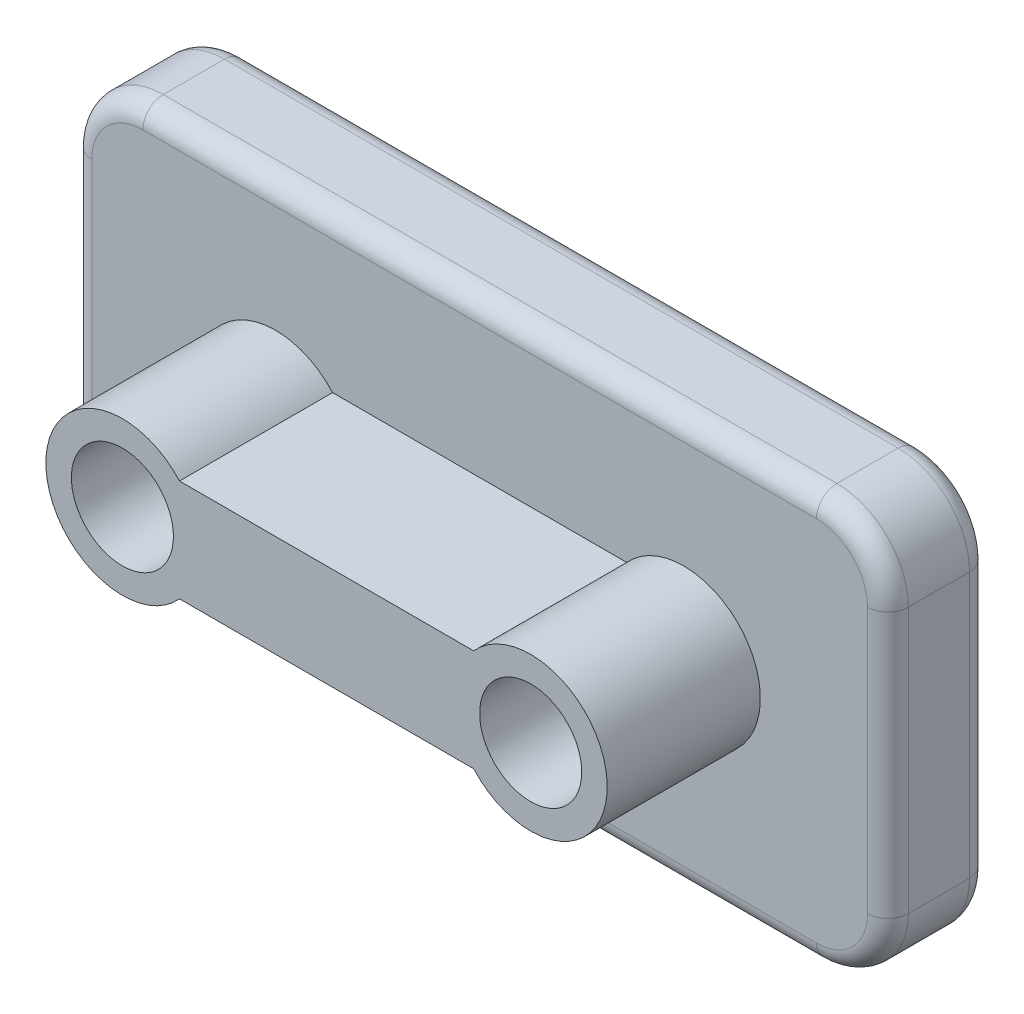
ISO-10303-21;
HEADER;
FILE_DESCRIPTION(('STEP AP214'),'2;1');
FILE_NAME('part.step','',(''),(''),'','','');
FILE_SCHEMA(('AUTOMOTIVE_DESIGN { 1 0 10303 214 1 1 1 1 }'));
ENDSEC;
DATA;
#1=APPLICATION_CONTEXT('core data for automotive mechanical design processes');
#2=APPLICATION_PROTOCOL_DEFINITION('international standard','automotive_design',2000,#1);
#3=PRODUCT_CONTEXT('',#1,'mechanical');
#4=PRODUCT('Part','Part','',(#3));
#5=PRODUCT_RELATED_PRODUCT_CATEGORY('part','',(#4));
#6=PRODUCT_DEFINITION_FORMATION('','',#4);
#7=PRODUCT_DEFINITION_CONTEXT('part definition',#1,'design');
#8=PRODUCT_DEFINITION('design','',#6,#7);
#9=PRODUCT_DEFINITION_SHAPE('','',#8);
#10=(LENGTH_UNIT() NAMED_UNIT(*) SI_UNIT(.MILLI.,.METRE.));
#11=(NAMED_UNIT(*) PLANE_ANGLE_UNIT() SI_UNIT($,.RADIAN.));
#12=(NAMED_UNIT(*) SI_UNIT($,.STERADIAN.) SOLID_ANGLE_UNIT());
#13=UNCERTAINTY_MEASURE_WITH_UNIT(LENGTH_MEASURE(1.E-05),#10,'distance_accuracy_value','');
#14=(GEOMETRIC_REPRESENTATION_CONTEXT(3) GLOBAL_UNCERTAINTY_ASSIGNED_CONTEXT((#13)) GLOBAL_UNIT_ASSIGNED_CONTEXT((#10,
#11,#12)) REPRESENTATION_CONTEXT('',''));
#15=CARTESIAN_POINT('',(0.,0.,0.));
#16=DIRECTION('',(0.,0.,1.));
#17=DIRECTION('',(1.,0.,0.));
#18=AXIS2_PLACEMENT_3D('',#15,#16,#17);
#19=CARTESIAN_POINT('',(7.,7.,10.));
#20=DIRECTION('',(0.,0.,-1.));
#21=DIRECTION('',(-1.,0.,0.));
#22=AXIS2_PLACEMENT_3D('',#19,#20,#21);
#23=CYLINDRICAL_SURFACE('',#22,7.);
#24=DIRECTION('',(0.,0.,-1.));
#25=VECTOR('',#24,1.);
#26=CARTESIAN_POINT('',(7.,0.,10.));
#27=LINE('',#26,#25);
#28=CARTESIAN_POINT('',(7.,0.,8.));
#29=VERTEX_POINT('',#28);
#30=CARTESIAN_POINT('',(7.,0.,2.));
#31=VERTEX_POINT('',#30);
#32=EDGE_CURVE('E203',#29,#31,#27,.T.);
#33=ORIENTED_EDGE('',*,*,#32,.F.);
#34=CARTESIAN_POINT('',(7.,7.,8.));
#35=DIRECTION('',(0.,0.,-1.));
#36=DIRECTION('',(-1.,0.,0.));
#37=AXIS2_PLACEMENT_3D('',#34,#35,#36);
#38=CIRCLE('',#37,7.);
#39=CARTESIAN_POINT('',(0.,7.,8.));
#40=VERTEX_POINT('',#39);
#41=EDGE_CURVE('E313',#29,#40,#38,.T.);
#42=ORIENTED_EDGE('',*,*,#41,.T.);
#43=DIRECTION('',(0.,0.,-1.));
#44=VECTOR('',#43,1.);
#45=CARTESIAN_POINT('',(0.,7.,10.));
#46=LINE('',#45,#44);
#47=CARTESIAN_POINT('',(0.,7.,2.));
#48=VERTEX_POINT('',#47);
#49=EDGE_CURVE('E219',#40,#48,#46,.T.);
#50=ORIENTED_EDGE('',*,*,#49,.T.);
#51=CARTESIAN_POINT('',(7.,7.,2.));
#52=DIRECTION('',(0.,0.,-1.));
#53=DIRECTION('',(-1.,0.,0.));
#54=AXIS2_PLACEMENT_3D('',#51,#52,#53);
#55=CIRCLE('',#54,7.);
#56=EDGE_CURVE('E258',#48,#31,#55,.F.);
#57=ORIENTED_EDGE('',*,*,#56,.T.);
#58=EDGE_LOOP('',(#33,#42,#50,#57));
#59=FACE_BOUND('',#58,.T.);
#60=ADVANCED_FACE('F33',(#59),#23,.T.);
#61=CARTESIAN_POINT('',(7.,0.,10.));
#62=DIRECTION('',(0.,1.,0.));
#63=DIRECTION('',(0.,0.,1.));
#64=AXIS2_PLACEMENT_3D('',#61,#62,#63);
#65=PLANE('',#64);
#66=DIRECTION('',(0.,0.,-1.));
#67=VECTOR('',#66,1.);
#68=CARTESIAN_POINT('',(73.,0.,10.));
#69=LINE('',#68,#67);
#70=CARTESIAN_POINT('',(73.,0.,8.));
#71=VERTEX_POINT('',#70);
#72=CARTESIAN_POINT('',(73.,0.,2.));
#73=VERTEX_POINT('',#72);
#74=EDGE_CURVE('E206',#71,#73,#69,.T.);
#75=ORIENTED_EDGE('',*,*,#74,.F.);
#76=DIRECTION('',(1.,0.,0.));
#77=VECTOR('',#76,1.);
#78=CARTESIAN_POINT('',(7.,0.,8.));
#79=LINE('',#78,#77);
#80=EDGE_CURVE('E56',#71,#29,#79,.F.);
#81=ORIENTED_EDGE('',*,*,#80,.T.);
#82=ORIENTED_EDGE('',*,*,#32,.T.);
#83=DIRECTION('',(1.,0.,0.));
#84=VECTOR('',#83,1.);
#85=CARTESIAN_POINT('',(73.,0.,2.));
#86=LINE('',#85,#84);
#87=EDGE_CURVE('E205',#31,#73,#86,.T.);
#88=ORIENTED_EDGE('',*,*,#87,.T.);
#89=EDGE_LOOP('',(#75,#81,#82,#88));
#90=FACE_BOUND('',#89,.T.);
#91=ADVANCED_FACE('F380',(#90),#65,.F.);
#92=CARTESIAN_POINT('',(73.,7.,10.));
#93=DIRECTION('',(0.,0.,-1.));
#94=DIRECTION('',(-1.,0.,0.));
#95=AXIS2_PLACEMENT_3D('',#92,#93,#94);
#96=CYLINDRICAL_SURFACE('',#95,7.);
#97=DIRECTION('',(0.,0.,-1.));
#98=VECTOR('',#97,1.);
#99=CARTESIAN_POINT('',(80.,7.,10.));
#100=LINE('',#99,#98);
#101=CARTESIAN_POINT('',(80.,7.,8.));
#102=VERTEX_POINT('',#101);
#103=CARTESIAN_POINT('',(80.,7.,2.));
#104=VERTEX_POINT('',#103);
#105=EDGE_CURVE('E208',#102,#104,#100,.T.);
#106=ORIENTED_EDGE('',*,*,#105,.F.);
#107=CARTESIAN_POINT('',(73.,7.,8.));
#108=DIRECTION('',(0.,0.,-1.));
#109=DIRECTION('',(-1.,0.,0.));
#110=AXIS2_PLACEMENT_3D('',#107,#108,#109);
#111=CIRCLE('',#110,7.);
#112=EDGE_CURVE('E310',#102,#71,#111,.T.);
#113=ORIENTED_EDGE('',*,*,#112,.T.);
#114=ORIENTED_EDGE('',*,*,#74,.T.);
#115=CARTESIAN_POINT('',(73.,7.,2.));
#116=DIRECTION('',(0.,0.,-1.));
#117=DIRECTION('',(-1.,0.,0.));
#118=AXIS2_PLACEMENT_3D('',#115,#116,#117);
#119=CIRCLE('',#118,7.);
#120=EDGE_CURVE('E242',#73,#104,#119,.F.);
#121=ORIENTED_EDGE('',*,*,#120,.T.);
#122=EDGE_LOOP('',(#106,#113,#114,#121));
#123=FACE_BOUND('',#122,.T.);
#124=ADVANCED_FACE('F383',(#123),#96,.T.);
#125=CARTESIAN_POINT('',(80.,7.,10.));
#126=DIRECTION('',(-1.,0.,0.));
#127=DIRECTION('',(0.,0.,1.));
#128=AXIS2_PLACEMENT_3D('',#125,#126,#127);
#129=PLANE('',#128);
#130=DIRECTION('',(0.,1.,0.));
#131=VECTOR('',#130,1.);
#132=CARTESIAN_POINT('',(80.,7.,8.));
#133=LINE('',#132,#131);
#134=CARTESIAN_POINT('',(80.,33.,8.));
#135=VERTEX_POINT('',#134);
#136=EDGE_CURVE('E308',#135,#102,#133,.F.);
#137=ORIENTED_EDGE('',*,*,#136,.T.);
#138=ORIENTED_EDGE('',*,*,#105,.T.);
#139=DIRECTION('',(0.,1.,0.));
#140=VECTOR('',#139,1.);
#141=CARTESIAN_POINT('',(80.,33.,2.));
#142=LINE('',#141,#140);
#143=CARTESIAN_POINT('',(80.,33.,2.));
#144=VERTEX_POINT('',#143);
#145=EDGE_CURVE('E245',#104,#144,#142,.T.);
#146=ORIENTED_EDGE('',*,*,#145,.T.);
#147=DIRECTION('',(0.,0.,-1.));
#148=VECTOR('',#147,1.);
#149=CARTESIAN_POINT('',(80.,33.,10.));
#150=LINE('',#149,#148);
#151=EDGE_CURVE('E210',#135,#144,#150,.T.);
#152=ORIENTED_EDGE('',*,*,#151,.F.);
#153=EDGE_LOOP('',(#137,#138,#146,#152));
#154=FACE_BOUND('',#153,.T.);
#155=ADVANCED_FACE('F386',(#154),#129,.F.);
#156=CARTESIAN_POINT('',(73.,33.,10.));
#157=DIRECTION('',(0.,0.,-1.));
#158=DIRECTION('',(-1.,0.,0.));
#159=AXIS2_PLACEMENT_3D('',#156,#157,#158);
#160=CYLINDRICAL_SURFACE('',#159,7.00000000000001);
#161=DIRECTION('',(0.,0.,-1.));
#162=VECTOR('',#161,1.);
#163=CARTESIAN_POINT('',(73.,40.,10.));
#164=LINE('',#163,#162);
#165=CARTESIAN_POINT('',(73.,40.,8.));
#166=VERTEX_POINT('',#165);
#167=CARTESIAN_POINT('',(73.,40.,2.));
#168=VERTEX_POINT('',#167);
#169=EDGE_CURVE('E213',#166,#168,#164,.T.);
#170=ORIENTED_EDGE('',*,*,#169,.F.);
#171=CARTESIAN_POINT('',(73.,33.,8.));
#172=DIRECTION('',(0.,0.,-1.));
#173=DIRECTION('',(-1.,0.,0.));
#174=AXIS2_PLACEMENT_3D('',#171,#172,#173);
#175=CIRCLE('',#174,7.00000000000001);
#176=EDGE_CURVE('E306',#166,#135,#175,.T.);
#177=ORIENTED_EDGE('',*,*,#176,.T.);
#178=ORIENTED_EDGE('',*,*,#151,.T.);
#179=CARTESIAN_POINT('',(73.,33.,2.));
#180=DIRECTION('',(0.,0.,-1.));
#181=DIRECTION('',(-1.,0.,0.));
#182=AXIS2_PLACEMENT_3D('',#179,#180,#181);
#183=CIRCLE('',#182,7.00000000000001);
#184=EDGE_CURVE('E247',#144,#168,#183,.F.);
#185=ORIENTED_EDGE('',*,*,#184,.T.);
#186=EDGE_LOOP('',(#170,#177,#178,#185));
#187=FACE_BOUND('',#186,.T.);
#188=ADVANCED_FACE('F391',(#187),#160,.T.);
#189=CARTESIAN_POINT('',(7.,40.,10.));
#190=DIRECTION('',(0.,1.,0.));
#191=DIRECTION('',(0.,0.,1.));
#192=AXIS2_PLACEMENT_3D('',#189,#190,#191);
#193=PLANE('',#192);
#194=DIRECTION('',(0.,0.,-1.));
#195=VECTOR('',#194,1.);
#196=CARTESIAN_POINT('',(7.,40.,10.));
#197=LINE('',#196,#195);
#198=CARTESIAN_POINT('',(7.,40.,8.));
#199=VERTEX_POINT('',#198);
#200=CARTESIAN_POINT('',(7.,40.,2.));
#201=VERTEX_POINT('',#200);
#202=EDGE_CURVE('E215',#199,#201,#197,.T.);
#203=ORIENTED_EDGE('',*,*,#202,.F.);
#204=DIRECTION('',(1.,0.,0.));
#205=VECTOR('',#204,1.);
#206=CARTESIAN_POINT('',(73.,40.,8.));
#207=LINE('',#206,#205);
#208=EDGE_CURVE('E304',#199,#166,#207,.T.);
#209=ORIENTED_EDGE('',*,*,#208,.T.);
#210=ORIENTED_EDGE('',*,*,#169,.T.);
#211=DIRECTION('',(1.,0.,0.));
#212=VECTOR('',#211,1.);
#213=CARTESIAN_POINT('',(7.,40.,2.));
#214=LINE('',#213,#212);
#215=EDGE_CURVE('E250',#168,#201,#214,.F.);
#216=ORIENTED_EDGE('',*,*,#215,.T.);
#217=EDGE_LOOP('',(#203,#209,#210,#216));
#218=FACE_BOUND('',#217,.T.);
#219=ADVANCED_FACE('F414',(#218),#193,.T.);
#220=CARTESIAN_POINT('',(7.,33.,10.));
#221=DIRECTION('',(0.,0.,-1.));
#222=DIRECTION('',(-1.,0.,0.));
#223=AXIS2_PLACEMENT_3D('',#220,#221,#222);
#224=CYLINDRICAL_SURFACE('',#223,7.);
#225=DIRECTION('',(0.,0.,-1.));
#226=VECTOR('',#225,1.);
#227=CARTESIAN_POINT('',(0.,33.,10.));
#228=LINE('',#227,#226);
#229=CARTESIAN_POINT('',(0.,33.,8.));
#230=VERTEX_POINT('',#229);
#231=CARTESIAN_POINT('',(0.,33.,2.));
#232=VERTEX_POINT('',#231);
#233=EDGE_CURVE('E217',#230,#232,#228,.T.);
#234=ORIENTED_EDGE('',*,*,#233,.F.);
#235=CARTESIAN_POINT('',(7.,33.,8.));
#236=DIRECTION('',(0.,0.,-1.));
#237=DIRECTION('',(-1.,0.,0.));
#238=AXIS2_PLACEMENT_3D('',#235,#236,#237);
#239=CIRCLE('',#238,7.);
#240=EDGE_CURVE('E302',#230,#199,#239,.T.);
#241=ORIENTED_EDGE('',*,*,#240,.T.);
#242=ORIENTED_EDGE('',*,*,#202,.T.);
#243=CARTESIAN_POINT('',(7.,33.,2.));
#244=DIRECTION('',(0.,0.,-1.));
#245=DIRECTION('',(-1.,0.,0.));
#246=AXIS2_PLACEMENT_3D('',#243,#244,#245);
#247=CIRCLE('',#246,7.);
#248=EDGE_CURVE('E253',#201,#232,#247,.F.);
#249=ORIENTED_EDGE('',*,*,#248,.T.);
#250=EDGE_LOOP('',(#234,#241,#242,#249));
#251=FACE_BOUND('',#250,.T.);
#252=ADVANCED_FACE('F431',(#251),#224,.T.);
#253=CARTESIAN_POINT('',(0.,7.,10.));
#254=DIRECTION('',(-1.,0.,0.));
#255=DIRECTION('',(0.,0.,1.));
#256=AXIS2_PLACEMENT_3D('',#253,#254,#255);
#257=PLANE('',#256);
#258=DIRECTION('',(0.,1.,0.));
#259=VECTOR('',#258,1.);
#260=CARTESIAN_POINT('',(0.,33.,8.));
#261=LINE('',#260,#259);
#262=EDGE_CURVE('E261',#40,#230,#261,.T.);
#263=ORIENTED_EDGE('',*,*,#262,.T.);
#264=ORIENTED_EDGE('',*,*,#233,.T.);
#265=DIRECTION('',(0.,1.,0.));
#266=VECTOR('',#265,1.);
#267=CARTESIAN_POINT('',(0.,7.,2.));
#268=LINE('',#267,#266);
#269=EDGE_CURVE('E256',#232,#48,#268,.F.);
#270=ORIENTED_EDGE('',*,*,#269,.T.);
#271=ORIENTED_EDGE('',*,*,#49,.F.);
#272=EDGE_LOOP('',(#263,#264,#270,#271));
#273=FACE_BOUND('',#272,.T.);
#274=ADVANCED_FACE('F362',(#273),#257,.T.);
#275=CARTESIAN_POINT('',(7.,7.,10.));
#276=DIRECTION('',(0.,0.,-1.));
#277=DIRECTION('',(-1.,0.,0.));
#278=AXIS2_PLACEMENT_3D('',#275,#276,#277);
#279=PLANE('',#278);
#280=DIRECTION('',(0.,1.,0.));
#281=VECTOR('',#280,1.);
#282=CARTESIAN_POINT('',(78.,7.,10.));
#283=LINE('',#282,#281);
#284=CARTESIAN_POINT('',(78.,7.,10.));
#285=VERTEX_POINT('',#284);
#286=CARTESIAN_POINT('',(78.,33.,10.));
#287=VERTEX_POINT('',#286);
#288=EDGE_CURVE('E292',#285,#287,#283,.T.);
#289=ORIENTED_EDGE('',*,*,#288,.T.);
#290=CARTESIAN_POINT('',(73.,33.,10.));
#291=DIRECTION('',(0.,0.,-1.));
#292=DIRECTION('',(-1.,0.,0.));
#293=AXIS2_PLACEMENT_3D('',#290,#291,#292);
#294=CIRCLE('',#293,5.00000000000001);
#295=CARTESIAN_POINT('',(73.,38.,10.));
#296=VERTEX_POINT('',#295);
#297=EDGE_CURVE('E294',#287,#296,#294,.F.);
#298=ORIENTED_EDGE('',*,*,#297,.T.);
#299=DIRECTION('',(1.,0.,0.));
#300=VECTOR('',#299,1.);
#301=CARTESIAN_POINT('',(7.,38.,10.));
#302=LINE('',#301,#300);
#303=CARTESIAN_POINT('',(7.,38.,10.));
#304=VERTEX_POINT('',#303);
#305=EDGE_CURVE('E296',#296,#304,#302,.F.);
#306=ORIENTED_EDGE('',*,*,#305,.T.);
#307=CARTESIAN_POINT('',(7.,33.,10.));
#308=DIRECTION('',(0.,0.,-1.));
#309=DIRECTION('',(-1.,0.,0.));
#310=AXIS2_PLACEMENT_3D('',#307,#308,#309);
#311=CIRCLE('',#310,5.);
#312=CARTESIAN_POINT('',(2.,33.,10.));
#313=VERTEX_POINT('',#312);
#314=EDGE_CURVE('E298',#304,#313,#311,.F.);
#315=ORIENTED_EDGE('',*,*,#314,.T.);
#316=DIRECTION('',(0.,1.,0.));
#317=VECTOR('',#316,1.);
#318=CARTESIAN_POINT('',(2.,7.,10.));
#319=LINE('',#318,#317);
#320=CARTESIAN_POINT('',(2.,7.,10.));
#321=VERTEX_POINT('',#320);
#322=EDGE_CURVE('E300',#313,#321,#319,.F.);
#323=ORIENTED_EDGE('',*,*,#322,.T.);
#324=CARTESIAN_POINT('',(7.,7.,10.));
#325=DIRECTION('',(0.,0.,-1.));
#326=DIRECTION('',(-1.,0.,0.));
#327=AXIS2_PLACEMENT_3D('',#324,#325,#326);
#328=CIRCLE('',#327,5.);
#329=CARTESIAN_POINT('',(7.,2.,10.));
#330=VERTEX_POINT('',#329);
#331=EDGE_CURVE('E286',#321,#330,#328,.F.);
#332=ORIENTED_EDGE('',*,*,#331,.T.);
#333=DIRECTION('',(1.,0.,0.));
#334=VECTOR('',#333,1.);
#335=CARTESIAN_POINT('',(7.,2.,10.));
#336=LINE('',#335,#334);
#337=CARTESIAN_POINT('',(73.,2.,10.));
#338=VERTEX_POINT('',#337);
#339=EDGE_CURVE('E288',#330,#338,#336,.T.);
#340=ORIENTED_EDGE('',*,*,#339,.T.);
#341=CARTESIAN_POINT('',(73.,7.,10.));
#342=DIRECTION('',(0.,0.,-1.));
#343=DIRECTION('',(-1.,0.,0.));
#344=AXIS2_PLACEMENT_3D('',#341,#342,#343);
#345=CIRCLE('',#344,5.);
#346=EDGE_CURVE('E290',#338,#285,#345,.F.);
#347=ORIENTED_EDGE('',*,*,#346,.T.);
#348=EDGE_LOOP('',(#289,#298,#306,#315,#323,#332,#340,#347));
#349=FACE_BOUND('',#348,.T.);
#350=DIRECTION('',(-1.,0.,0.));
#351=VECTOR('',#350,1.);
#352=CARTESIAN_POINT('',(7.,25.,10.));
#353=LINE('',#352,#351);
#354=CARTESIAN_POINT('',(54.4098300562505,25.,10.));
#355=VERTEX_POINT('',#354);
#356=CARTESIAN_POINT('',(25.5901699437495,25.,10.));
#357=VERTEX_POINT('',#356);
#358=EDGE_CURVE('E749',#355,#357,#353,.T.);
#359=ORIENTED_EDGE('',*,*,#358,.F.);
#360=CARTESIAN_POINT('',(60.,20.,10.));
#361=DIRECTION('',(0.,0.,-1.));
#362=DIRECTION('',(-1.,0.,0.));
#363=AXIS2_PLACEMENT_3D('',#360,#361,#362);
#364=CIRCLE('',#363,7.50000000000001);
#365=CARTESIAN_POINT('',(54.4098300562505,15.,10.));
#366=VERTEX_POINT('',#365);
#367=EDGE_CURVE('E41',#366,#355,#364,.F.);
#368=ORIENTED_EDGE('',*,*,#367,.F.);
#369=DIRECTION('',(-1.,0.,0.));
#370=VECTOR('',#369,1.);
#371=CARTESIAN_POINT('',(7.,15.,10.));
#372=LINE('',#371,#370);
#373=CARTESIAN_POINT('',(25.5901699437495,15.,10.));
#374=VERTEX_POINT('',#373);
#375=EDGE_CURVE('E744',#366,#374,#372,.T.);
#376=ORIENTED_EDGE('',*,*,#375,.T.);
#377=CARTESIAN_POINT('',(20.,20.,10.));
#378=DIRECTION('',(0.,0.,-1.));
#379=DIRECTION('',(-1.,0.,0.));
#380=AXIS2_PLACEMENT_3D('',#377,#378,#379);
#381=CIRCLE('',#380,7.5);
#382=EDGE_CURVE('E11',#357,#374,#381,.F.);
#383=ORIENTED_EDGE('',*,*,#382,.F.);
#384=EDGE_LOOP('',(#359,#368,#376,#383));
#385=FACE_BOUND('',#384,.T.);
#386=ADVANCED_FACE('F345',(#349,#385),#279,.F.);
#387=CARTESIAN_POINT('',(7.,7.,0.));
#388=DIRECTION('',(0.,0.,-1.));
#389=DIRECTION('',(-1.,0.,0.));
#390=AXIS2_PLACEMENT_3D('',#387,#388,#389);
#391=PLANE('',#390);
#392=DIRECTION('',(0.,1.,0.));
#393=VECTOR('',#392,1.);
#394=CARTESIAN_POINT('',(78.,7.,0.));
#395=LINE('',#394,#393);
#396=CARTESIAN_POINT('',(78.,33.,0.));
#397=VERTEX_POINT('',#396);
#398=CARTESIAN_POINT('',(78.,7.,0.));
#399=VERTEX_POINT('',#398);
#400=EDGE_CURVE('E235',#397,#399,#395,.F.);
#401=ORIENTED_EDGE('',*,*,#400,.T.);
#402=CARTESIAN_POINT('',(73.,7.,0.));
#403=DIRECTION('',(0.,0.,-1.));
#404=DIRECTION('',(-1.,0.,0.));
#405=AXIS2_PLACEMENT_3D('',#402,#403,#404);
#406=CIRCLE('',#405,5.);
#407=CARTESIAN_POINT('',(73.,2.,0.));
#408=VERTEX_POINT('',#407);
#409=EDGE_CURVE('E237',#399,#408,#406,.T.);
#410=ORIENTED_EDGE('',*,*,#409,.T.);
#411=DIRECTION('',(1.,0.,0.));
#412=VECTOR('',#411,1.);
#413=CARTESIAN_POINT('',(7.,2.,0.));
#414=LINE('',#413,#412);
#415=CARTESIAN_POINT('',(7.,2.,0.));
#416=VERTEX_POINT('',#415);
#417=EDGE_CURVE('E239',#408,#416,#414,.F.);
#418=ORIENTED_EDGE('',*,*,#417,.T.);
#419=CARTESIAN_POINT('',(7.,7.,0.));
#420=DIRECTION('',(0.,0.,-1.));
#421=DIRECTION('',(-1.,0.,0.));
#422=AXIS2_PLACEMENT_3D('',#419,#420,#421);
#423=CIRCLE('',#422,5.);
#424=CARTESIAN_POINT('',(2.,7.,0.));
#425=VERTEX_POINT('',#424);
#426=EDGE_CURVE('E225',#416,#425,#423,.T.);
#427=ORIENTED_EDGE('',*,*,#426,.T.);
#428=DIRECTION('',(0.,1.,0.));
#429=VECTOR('',#428,1.);
#430=CARTESIAN_POINT('',(2.,7.,0.));
#431=LINE('',#430,#429);
#432=CARTESIAN_POINT('',(2.,33.,0.));
#433=VERTEX_POINT('',#432);
#434=EDGE_CURVE('E227',#425,#433,#431,.T.);
#435=ORIENTED_EDGE('',*,*,#434,.T.);
#436=CARTESIAN_POINT('',(7.,33.,0.));
#437=DIRECTION('',(0.,0.,-1.));
#438=DIRECTION('',(-1.,0.,0.));
#439=AXIS2_PLACEMENT_3D('',#436,#437,#438);
#440=CIRCLE('',#439,5.);
#441=CARTESIAN_POINT('',(7.,38.,0.));
#442=VERTEX_POINT('',#441);
#443=EDGE_CURVE('E229',#433,#442,#440,.T.);
#444=ORIENTED_EDGE('',*,*,#443,.T.);
#445=DIRECTION('',(1.,0.,0.));
#446=VECTOR('',#445,1.);
#447=CARTESIAN_POINT('',(7.,38.,0.));
#448=LINE('',#447,#446);
#449=CARTESIAN_POINT('',(73.,38.,0.));
#450=VERTEX_POINT('',#449);
#451=EDGE_CURVE('E231',#442,#450,#448,.T.);
#452=ORIENTED_EDGE('',*,*,#451,.T.);
#453=CARTESIAN_POINT('',(73.,33.,0.));
#454=DIRECTION('',(0.,0.,-1.));
#455=DIRECTION('',(-1.,0.,0.));
#456=AXIS2_PLACEMENT_3D('',#453,#454,#455);
#457=CIRCLE('',#456,5.00000000000001);
#458=EDGE_CURVE('E233',#450,#397,#457,.T.);
#459=ORIENTED_EDGE('',*,*,#458,.T.);
#460=EDGE_LOOP('',(#401,#410,#418,#427,#435,#444,#452,#459));
#461=FACE_BOUND('',#460,.T.);
#462=ADVANCED_FACE('F405',(#461),#391,.T.);
#463=CARTESIAN_POINT('',(7.,38.,2.));
#464=DIRECTION('',(1.,0.,0.));
#465=DIRECTION('',(0.,0.,-1.));
#466=AXIS2_PLACEMENT_3D('',#463,#464,#465);
#467=CYLINDRICAL_SURFACE('',#466,2.);
#468=CARTESIAN_POINT('',(73.,38.,2.));
#469=DIRECTION('',(1.,0.,0.));
#470=DIRECTION('',(0.,0.,-1.));
#471=AXIS2_PLACEMENT_3D('',#468,#469,#470);
#472=CIRCLE('',#471,2.);
#473=EDGE_CURVE('E280',#450,#168,#472,.T.);
#474=ORIENTED_EDGE('',*,*,#473,.F.);
#475=ORIENTED_EDGE('',*,*,#451,.F.);
#476=CARTESIAN_POINT('',(7.,38.,2.));
#477=DIRECTION('',(-1.,0.,0.));
#478=DIRECTION('',(0.,0.,1.));
#479=AXIS2_PLACEMENT_3D('',#476,#477,#478);
#480=CIRCLE('',#479,2.);
#481=EDGE_CURVE('E222',#201,#442,#480,.T.);
#482=ORIENTED_EDGE('',*,*,#481,.F.);
#483=ORIENTED_EDGE('',*,*,#215,.F.);
#484=EDGE_LOOP('',(#474,#475,#482,#483));
#485=FACE_BOUND('',#484,.T.);
#486=ADVANCED_FACE('F410',(#485),#467,.T.);
#487=CARTESIAN_POINT('',(7.,33.,2.));
#488=DIRECTION('',(0.,0.,-1.));
#489=DIRECTION('',(-1.,0.,0.));
#490=AXIS2_PLACEMENT_3D('',#487,#488,#489);
#491=TOROIDAL_SURFACE('',#490,5.,2.);
#492=ORIENTED_EDGE('',*,*,#481,.T.);
#493=ORIENTED_EDGE('',*,*,#443,.F.);
#494=CARTESIAN_POINT('',(2.,33.,2.));
#495=DIRECTION('',(0.,-1.,0.));
#496=DIRECTION('',(0.,0.,-1.));
#497=AXIS2_PLACEMENT_3D('',#494,#495,#496);
#498=CIRCLE('',#497,2.);
#499=EDGE_CURVE('E277',#232,#433,#498,.T.);
#500=ORIENTED_EDGE('',*,*,#499,.F.);
#501=ORIENTED_EDGE('',*,*,#248,.F.);
#502=EDGE_LOOP('',(#492,#493,#500,#501));
#503=FACE_BOUND('',#502,.T.);
#504=ADVANCED_FACE('F433',(#503),#491,.T.);
#505=CARTESIAN_POINT('',(73.,33.,2.));
#506=DIRECTION('',(0.,0.,-1.));
#507=DIRECTION('',(-1.,0.,0.));
#508=AXIS2_PLACEMENT_3D('',#505,#506,#507);
#509=TOROIDAL_SURFACE('',#508,5.00000000000001,2.);
#510=ORIENTED_EDGE('',*,*,#473,.T.);
#511=ORIENTED_EDGE('',*,*,#184,.F.);
#512=CARTESIAN_POINT('',(78.,33.,2.));
#513=DIRECTION('',(0.,-1.,0.));
#514=DIRECTION('',(0.,0.,-1.));
#515=AXIS2_PLACEMENT_3D('',#512,#513,#514);
#516=CIRCLE('',#515,2.);
#517=EDGE_CURVE('E274',#397,#144,#516,.T.);
#518=ORIENTED_EDGE('',*,*,#517,.F.);
#519=ORIENTED_EDGE('',*,*,#458,.F.);
#520=EDGE_LOOP('',(#510,#511,#518,#519));
#521=FACE_BOUND('',#520,.T.);
#522=ADVANCED_FACE('F396',(#521),#509,.T.);
#523=CARTESIAN_POINT('',(2.,7.,2.));
#524=DIRECTION('',(0.,1.,0.));
#525=DIRECTION('',(0.,0.,1.));
#526=AXIS2_PLACEMENT_3D('',#523,#524,#525);
#527=CYLINDRICAL_SURFACE('',#526,2.);
#528=CARTESIAN_POINT('',(2.,7.,2.));
#529=DIRECTION('',(0.,-1.,0.));
#530=DIRECTION('',(0.,0.,-1.));
#531=AXIS2_PLACEMENT_3D('',#528,#529,#530);
#532=CIRCLE('',#531,2.);
#533=EDGE_CURVE('E271',#48,#425,#532,.T.);
#534=ORIENTED_EDGE('',*,*,#533,.F.);
#535=ORIENTED_EDGE('',*,*,#269,.F.);
#536=ORIENTED_EDGE('',*,*,#499,.T.);
#537=ORIENTED_EDGE('',*,*,#434,.F.);
#538=EDGE_LOOP('',(#534,#535,#536,#537));
#539=FACE_BOUND('',#538,.T.);
#540=ADVANCED_FACE('F366',(#539),#527,.T.);
#541=CARTESIAN_POINT('',(78.,7.,2.));
#542=DIRECTION('',(0.,-1.,0.));
#543=DIRECTION('',(0.,0.,-1.));
#544=AXIS2_PLACEMENT_3D('',#541,#542,#543);
#545=CYLINDRICAL_SURFACE('',#544,2.);
#546=ORIENTED_EDGE('',*,*,#517,.T.);
#547=ORIENTED_EDGE('',*,*,#145,.F.);
#548=CARTESIAN_POINT('',(78.,7.,2.));
#549=DIRECTION('',(0.,-1.,0.));
#550=DIRECTION('',(0.,0.,-1.));
#551=AXIS2_PLACEMENT_3D('',#548,#549,#550);
#552=CIRCLE('',#551,2.);
#553=EDGE_CURVE('E268',#399,#104,#552,.T.);
#554=ORIENTED_EDGE('',*,*,#553,.F.);
#555=ORIENTED_EDGE('',*,*,#400,.F.);
#556=EDGE_LOOP('',(#546,#547,#554,#555));
#557=FACE_BOUND('',#556,.T.);
#558=ADVANCED_FACE('F401',(#557),#545,.T.);
#559=CARTESIAN_POINT('',(7.,7.,2.));
#560=DIRECTION('',(0.,0.,-1.));
#561=DIRECTION('',(-1.,0.,0.));
#562=AXIS2_PLACEMENT_3D('',#559,#560,#561);
#563=TOROIDAL_SURFACE('',#562,5.,2.);
#564=ORIENTED_EDGE('',*,*,#533,.T.);
#565=ORIENTED_EDGE('',*,*,#426,.F.);
#566=CARTESIAN_POINT('',(7.,2.,2.));
#567=DIRECTION('',(1.,0.,0.));
#568=DIRECTION('',(0.,0.,-1.));
#569=AXIS2_PLACEMENT_3D('',#566,#567,#568);
#570=CIRCLE('',#569,2.);
#571=EDGE_CURVE('E265',#31,#416,#570,.T.);
#572=ORIENTED_EDGE('',*,*,#571,.F.);
#573=ORIENTED_EDGE('',*,*,#56,.F.);
#574=EDGE_LOOP('',(#564,#565,#572,#573));
#575=FACE_BOUND('',#574,.T.);
#576=ADVANCED_FACE('F373',(#575),#563,.T.);
#577=CARTESIAN_POINT('',(73.,7.,2.));
#578=DIRECTION('',(0.,0.,-1.));
#579=DIRECTION('',(-1.,0.,0.));
#580=AXIS2_PLACEMENT_3D('',#577,#578,#579);
#581=TOROIDAL_SURFACE('',#580,5.,2.);
#582=ORIENTED_EDGE('',*,*,#553,.T.);
#583=ORIENTED_EDGE('',*,*,#120,.F.);
#584=CARTESIAN_POINT('',(73.,2.,2.));
#585=DIRECTION('',(-1.,0.,0.));
#586=DIRECTION('',(0.,0.,1.));
#587=AXIS2_PLACEMENT_3D('',#584,#585,#586);
#588=CIRCLE('',#587,2.);
#589=EDGE_CURVE('E262',#408,#73,#588,.T.);
#590=ORIENTED_EDGE('',*,*,#589,.F.);
#591=ORIENTED_EDGE('',*,*,#409,.F.);
#592=EDGE_LOOP('',(#582,#583,#590,#591));
#593=FACE_BOUND('',#592,.T.);
#594=ADVANCED_FACE('F453',(#593),#581,.T.);
#595=CARTESIAN_POINT('',(7.,2.,2.));
#596=DIRECTION('',(-1.,0.,0.));
#597=DIRECTION('',(0.,0.,1.));
#598=AXIS2_PLACEMENT_3D('',#595,#596,#597);
#599=CYLINDRICAL_SURFACE('',#598,2.);
#600=ORIENTED_EDGE('',*,*,#571,.T.);
#601=ORIENTED_EDGE('',*,*,#417,.F.);
#602=ORIENTED_EDGE('',*,*,#589,.T.);
#603=ORIENTED_EDGE('',*,*,#87,.F.);
#604=EDGE_LOOP('',(#600,#601,#602,#603));
#605=FACE_BOUND('',#604,.T.);
#606=ADVANCED_FACE('F377',(#605),#599,.T.);
#607=CARTESIAN_POINT('',(78.,7.,8.));
#608=DIRECTION('',(0.,1.,0.));
#609=DIRECTION('',(0.,0.,1.));
#610=AXIS2_PLACEMENT_3D('',#607,#608,#609);
#611=CYLINDRICAL_SURFACE('',#610,2.);
#612=CARTESIAN_POINT('',(78.,33.,8.));
#613=DIRECTION('',(0.,1.,0.));
#614=DIRECTION('',(0.,0.,1.));
#615=AXIS2_PLACEMENT_3D('',#612,#613,#614);
#616=CIRCLE('',#615,2.);
#617=EDGE_CURVE('E329',#287,#135,#616,.T.);
#618=ORIENTED_EDGE('',*,*,#617,.F.);
#619=ORIENTED_EDGE('',*,*,#288,.F.);
#620=CARTESIAN_POINT('',(78.,7.,8.));
#621=DIRECTION('',(0.,-1.,0.));
#622=DIRECTION('',(0.,0.,-1.));
#623=AXIS2_PLACEMENT_3D('',#620,#621,#622);
#624=CIRCLE('',#623,2.);
#625=EDGE_CURVE('E266',#102,#285,#624,.T.);
#626=ORIENTED_EDGE('',*,*,#625,.F.);
#627=ORIENTED_EDGE('',*,*,#136,.F.);
#628=EDGE_LOOP('',(#618,#619,#626,#627));
#629=FACE_BOUND('',#628,.T.);
#630=ADVANCED_FACE('F35',(#629),#611,.T.);
#631=CARTESIAN_POINT('',(73.,7.,8.));
#632=DIRECTION('',(0.,0.,-1.));
#633=DIRECTION('',(-1.,0.,0.));
#634=AXIS2_PLACEMENT_3D('',#631,#632,#633);
#635=TOROIDAL_SURFACE('',#634,5.,2.);
#636=ORIENTED_EDGE('',*,*,#625,.T.);
#637=ORIENTED_EDGE('',*,*,#346,.F.);
#638=CARTESIAN_POINT('',(73.,2.,8.));
#639=DIRECTION('',(-1.,0.,0.));
#640=DIRECTION('',(0.,0.,1.));
#641=AXIS2_PLACEMENT_3D('',#638,#639,#640);
#642=CIRCLE('',#641,2.);
#643=EDGE_CURVE('E326',#71,#338,#642,.T.);
#644=ORIENTED_EDGE('',*,*,#643,.F.);
#645=ORIENTED_EDGE('',*,*,#112,.F.);
#646=EDGE_LOOP('',(#636,#637,#644,#645));
#647=FACE_BOUND('',#646,.T.);
#648=ADVANCED_FACE('F337',(#647),#635,.T.);
#649=CARTESIAN_POINT('',(73.,33.,8.));
#650=DIRECTION('',(0.,0.,-1.));
#651=DIRECTION('',(-1.,0.,0.));
#652=AXIS2_PLACEMENT_3D('',#649,#650,#651);
#653=TOROIDAL_SURFACE('',#652,5.00000000000001,2.);
#654=ORIENTED_EDGE('',*,*,#617,.T.);
#655=ORIENTED_EDGE('',*,*,#176,.F.);
#656=CARTESIAN_POINT('',(73.,38.,8.));
#657=DIRECTION('',(-1.,0.,0.));
#658=DIRECTION('',(0.,0.,1.));
#659=AXIS2_PLACEMENT_3D('',#656,#657,#658);
#660=CIRCLE('',#659,2.);
#661=EDGE_CURVE('E323',#296,#166,#660,.T.);
#662=ORIENTED_EDGE('',*,*,#661,.F.);
#663=ORIENTED_EDGE('',*,*,#297,.F.);
#664=EDGE_LOOP('',(#654,#655,#662,#663));
#665=FACE_BOUND('',#664,.T.);
#666=ADVANCED_FACE('F417',(#665),#653,.T.);
#667=CARTESIAN_POINT('',(7.,2.,8.));
#668=DIRECTION('',(1.,0.,0.));
#669=DIRECTION('',(0.,0.,-1.));
#670=AXIS2_PLACEMENT_3D('',#667,#668,#669);
#671=CYLINDRICAL_SURFACE('',#670,2.);
#672=ORIENTED_EDGE('',*,*,#643,.T.);
#673=ORIENTED_EDGE('',*,*,#339,.F.);
#674=CARTESIAN_POINT('',(7.,2.,8.));
#675=DIRECTION('',(-1.,0.,0.));
#676=DIRECTION('',(0.,0.,1.));
#677=AXIS2_PLACEMENT_3D('',#674,#675,#676);
#678=CIRCLE('',#677,2.);
#679=EDGE_CURVE('E320',#29,#330,#678,.T.);
#680=ORIENTED_EDGE('',*,*,#679,.F.);
#681=ORIENTED_EDGE('',*,*,#80,.F.);
#682=EDGE_LOOP('',(#672,#673,#680,#681));
#683=FACE_BOUND('',#682,.T.);
#684=ADVANCED_FACE('F352',(#683),#671,.T.);
#685=CARTESIAN_POINT('',(7.,38.,8.));
#686=DIRECTION('',(-1.,0.,0.));
#687=DIRECTION('',(0.,0.,1.));
#688=AXIS2_PLACEMENT_3D('',#685,#686,#687);
#689=CYLINDRICAL_SURFACE('',#688,2.);
#690=ORIENTED_EDGE('',*,*,#661,.T.);
#691=ORIENTED_EDGE('',*,*,#208,.F.);
#692=CARTESIAN_POINT('',(7.,38.,8.));
#693=DIRECTION('',(-1.,0.,0.));
#694=DIRECTION('',(0.,0.,1.));
#695=AXIS2_PLACEMENT_3D('',#692,#693,#694);
#696=CIRCLE('',#695,2.);
#697=EDGE_CURVE('E317',#304,#199,#696,.T.);
#698=ORIENTED_EDGE('',*,*,#697,.F.);
#699=ORIENTED_EDGE('',*,*,#305,.F.);
#700=EDGE_LOOP('',(#690,#691,#698,#699));
#701=FACE_BOUND('',#700,.T.);
#702=ADVANCED_FACE('F420',(#701),#689,.T.);
#703=CARTESIAN_POINT('',(7.,7.,8.));
#704=DIRECTION('',(0.,0.,-1.));
#705=DIRECTION('',(-1.,0.,0.));
#706=AXIS2_PLACEMENT_3D('',#703,#704,#705);
#707=TOROIDAL_SURFACE('',#706,5.,2.);
#708=ORIENTED_EDGE('',*,*,#679,.T.);
#709=ORIENTED_EDGE('',*,*,#331,.F.);
#710=CARTESIAN_POINT('',(2.,7.,8.));
#711=DIRECTION('',(0.,1.,0.));
#712=DIRECTION('',(0.,0.,1.));
#713=AXIS2_PLACEMENT_3D('',#710,#711,#712);
#714=CIRCLE('',#713,2.);
#715=EDGE_CURVE('E197',#40,#321,#714,.T.);
#716=ORIENTED_EDGE('',*,*,#715,.F.);
#717=ORIENTED_EDGE('',*,*,#41,.F.);
#718=EDGE_LOOP('',(#708,#709,#716,#717));
#719=FACE_BOUND('',#718,.T.);
#720=ADVANCED_FACE('F355',(#719),#707,.T.);
#721=CARTESIAN_POINT('',(7.,33.,8.));
#722=DIRECTION('',(0.,0.,-1.));
#723=DIRECTION('',(-1.,0.,0.));
#724=AXIS2_PLACEMENT_3D('',#721,#722,#723);
#725=TOROIDAL_SURFACE('',#724,5.,2.);
#726=ORIENTED_EDGE('',*,*,#697,.T.);
#727=ORIENTED_EDGE('',*,*,#240,.F.);
#728=CARTESIAN_POINT('',(2.,33.,8.));
#729=DIRECTION('',(0.,-1.,0.));
#730=DIRECTION('',(0.,0.,-1.));
#731=AXIS2_PLACEMENT_3D('',#728,#729,#730);
#732=CIRCLE('',#731,2.);
#733=EDGE_CURVE('E193',#313,#230,#732,.T.);
#734=ORIENTED_EDGE('',*,*,#733,.F.);
#735=ORIENTED_EDGE('',*,*,#314,.F.);
#736=EDGE_LOOP('',(#726,#727,#734,#735));
#737=FACE_BOUND('',#736,.T.);
#738=ADVANCED_FACE('F429',(#737),#725,.T.);
#739=CARTESIAN_POINT('',(2.,7.,8.));
#740=DIRECTION('',(0.,-1.,0.));
#741=DIRECTION('',(0.,0.,-1.));
#742=AXIS2_PLACEMENT_3D('',#739,#740,#741);
#743=CYLINDRICAL_SURFACE('',#742,2.);
#744=ORIENTED_EDGE('',*,*,#715,.T.);
#745=ORIENTED_EDGE('',*,*,#322,.F.);
#746=ORIENTED_EDGE('',*,*,#733,.T.);
#747=ORIENTED_EDGE('',*,*,#262,.F.);
#748=EDGE_LOOP('',(#744,#745,#746,#747));
#749=FACE_BOUND('',#748,.T.);
#750=ADVANCED_FACE('F427',(#749),#743,.T.);
#751=CARTESIAN_POINT('',(60.,20.,25.));
#752=DIRECTION('',(0.,0.,-1.));
#753=DIRECTION('',(-1.,0.,0.));
#754=AXIS2_PLACEMENT_3D('',#751,#752,#753);
#755=CYLINDRICAL_SURFACE('',#754,7.50000000000001);
#756=CARTESIAN_POINT('',(60.,20.,25.));
#757=DIRECTION('',(0.,0.,1.));
#758=DIRECTION('',(1.,0.,0.));
#759=AXIS2_PLACEMENT_3D('',#756,#757,#758);
#760=CIRCLE('',#759,7.50000000000001);
#761=CARTESIAN_POINT('',(54.4098300562505,15.,25.));
#762=VERTEX_POINT('',#761);
#763=CARTESIAN_POINT('',(54.4098300562505,25.,25.));
#764=VERTEX_POINT('',#763);
#765=EDGE_CURVE('E187',#762,#764,#760,.T.);
#766=ORIENTED_EDGE('',*,*,#765,.F.);
#767=DIRECTION('',(0.,0.,-1.));
#768=VECTOR('',#767,1.);
#769=CARTESIAN_POINT('',(54.4098300562505,15.,25.));
#770=LINE('',#769,#768);
#771=EDGE_CURVE('E189',#366,#762,#770,.F.);
#772=ORIENTED_EDGE('',*,*,#771,.F.);
#773=ORIENTED_EDGE('',*,*,#367,.T.);
#774=DIRECTION('',(0.,0.,-1.));
#775=VECTOR('',#774,1.);
#776=CARTESIAN_POINT('',(54.4098300562505,25.,25.));
#777=LINE('',#776,#775);
#778=EDGE_CURVE('E175',#355,#764,#777,.F.);
#779=ORIENTED_EDGE('',*,*,#778,.T.);
#780=EDGE_LOOP('',(#766,#772,#773,#779));
#781=FACE_BOUND('',#780,.T.);
#782=ADVANCED_FACE('F185',(#781),#755,.T.);
#783=CARTESIAN_POINT('',(60.,20.,25.));
#784=DIRECTION('',(0.,0.,1.));
#785=DIRECTION('',(1.,0.,0.));
#786=AXIS2_PLACEMENT_3D('',#783,#784,#785);
#787=PLANE('',#786);
#788=CARTESIAN_POINT('',(60.,20.,25.));
#789=DIRECTION('',(0.,0.,1.));
#790=DIRECTION('',(1.,0.,0.));
#791=AXIS2_PLACEMENT_3D('',#788,#789,#790);
#792=CIRCLE('',#791,5.);
#793=CARTESIAN_POINT('',(65.,20.,25.));
#794=VERTEX_POINT('',#793);
#795=EDGE_CURVE('E748',#794,#794,#792,.T.);
#796=ORIENTED_EDGE('',*,*,#795,.F.);
#797=EDGE_LOOP('',(#796));
#798=FACE_BOUND('',#797,.T.);
#799=ORIENTED_EDGE('',*,*,#765,.T.);
#800=DIRECTION('',(1.,0.,0.));
#801=VECTOR('',#800,1.);
#802=CARTESIAN_POINT('',(48.4361377084438,25.,25.));
#803=LINE('',#802,#801);
#804=CARTESIAN_POINT('',(25.5901699437495,25.,25.));
#805=VERTEX_POINT('',#804);
#806=EDGE_CURVE('E172',#764,#805,#803,.F.);
#807=ORIENTED_EDGE('',*,*,#806,.T.);
#808=CARTESIAN_POINT('',(20.,20.,25.));
#809=DIRECTION('',(0.,0.,1.));
#810=DIRECTION('',(1.,0.,0.));
#811=AXIS2_PLACEMENT_3D('',#808,#809,#810);
#812=CIRCLE('',#811,7.5);
#813=CARTESIAN_POINT('',(25.5901699437495,15.,25.));
#814=VERTEX_POINT('',#813);
#815=EDGE_CURVE('E194',#805,#814,#812,.T.);
#816=ORIENTED_EDGE('',*,*,#815,.T.);
#817=DIRECTION('',(1.,0.,0.));
#818=VECTOR('',#817,1.);
#819=CARTESIAN_POINT('',(48.4361377084438,15.,25.));
#820=LINE('',#819,#818);
#821=EDGE_CURVE('E48',#762,#814,#820,.F.);
#822=ORIENTED_EDGE('',*,*,#821,.F.);
#823=EDGE_LOOP('',(#799,#807,#816,#822));
#824=FACE_BOUND('',#823,.T.);
#825=CARTESIAN_POINT('',(20.,20.,25.));
#826=DIRECTION('',(0.,0.,1.));
#827=DIRECTION('',(1.,0.,0.));
#828=AXIS2_PLACEMENT_3D('',#825,#826,#827);
#829=CIRCLE('',#828,5.);
#830=CARTESIAN_POINT('',(25.,20.,25.));
#831=VERTEX_POINT('',#830);
#832=EDGE_CURVE('E761',#831,#831,#829,.T.);
#833=ORIENTED_EDGE('',*,*,#832,.F.);
#834=EDGE_LOOP('',(#833));
#835=FACE_BOUND('',#834,.T.);
#836=ADVANCED_FACE('F191',(#798,#824,#835),#787,.T.);
#837=CARTESIAN_POINT('',(20.,20.,25.));
#838=DIRECTION('',(0.,0.,-1.));
#839=DIRECTION('',(-1.,0.,0.));
#840=AXIS2_PLACEMENT_3D('',#837,#838,#839);
#841=CYLINDRICAL_SURFACE('',#840,7.5);
#842=DIRECTION('',(0.,0.,-1.));
#843=VECTOR('',#842,1.);
#844=CARTESIAN_POINT('',(25.5901699437495,15.,25.));
#845=LINE('',#844,#843);
#846=EDGE_CURVE('E746',#374,#814,#845,.F.);
#847=ORIENTED_EDGE('',*,*,#846,.T.);
#848=ORIENTED_EDGE('',*,*,#815,.F.);
#849=DIRECTION('',(0.,0.,-1.));
#850=VECTOR('',#849,1.);
#851=CARTESIAN_POINT('',(25.5901699437495,25.,25.));
#852=LINE('',#851,#850);
#853=EDGE_CURVE('E177',#357,#805,#852,.F.);
#854=ORIENTED_EDGE('',*,*,#853,.F.);
#855=ORIENTED_EDGE('',*,*,#382,.T.);
#856=EDGE_LOOP('',(#847,#848,#854,#855));
#857=FACE_BOUND('',#856,.T.);
#858=ADVANCED_FACE('F543',(#857),#841,.T.);
#859=CARTESIAN_POINT('',(7.,7.,10.));
#860=DIRECTION('',(0.,0.,-1.));
#861=DIRECTION('',(-1.,0.,0.));
#862=AXIS2_PLACEMENT_3D('',#859,#860,#861);
#863=PLANE('',#862);
#864=CARTESIAN_POINT('',(20.,20.,10.));
#865=DIRECTION('',(0.,0.,-1.));
#866=DIRECTION('',(-1.,0.,0.));
#867=AXIS2_PLACEMENT_3D('',#864,#865,#866);
#868=CIRCLE('',#867,5.);
#869=CARTESIAN_POINT('',(15.,20.,10.));
#870=VERTEX_POINT('',#869);
#871=EDGE_CURVE('E199',#870,#870,#868,.F.);
#872=ORIENTED_EDGE('',*,*,#871,.T.);
#873=EDGE_LOOP('',(#872));
#874=FACE_BOUND('',#873,.T.);
#875=ADVANCED_FACE('F551',(#874),#863,.F.);
#876=CARTESIAN_POINT('',(20.,20.,-4.14213562373095));
#877=DIRECTION('',(0.,0.,1.));
#878=DIRECTION('',(1.,0.,0.));
#879=AXIS2_PLACEMENT_3D('',#876,#877,#878);
#880=CYLINDRICAL_SURFACE('',#879,5.);
#881=ORIENTED_EDGE('',*,*,#871,.F.);
#882=EDGE_LOOP('',(#881));
#883=FACE_BOUND('',#882,.T.);
#884=ORIENTED_EDGE('',*,*,#832,.T.);
#885=EDGE_LOOP('',(#884));
#886=FACE_BOUND('',#885,.T.);
#887=ADVANCED_FACE('F559',(#883,#886),#880,.F.);
#888=CARTESIAN_POINT('',(7.,7.,10.));
#889=DIRECTION('',(0.,0.,-1.));
#890=DIRECTION('',(-1.,0.,0.));
#891=AXIS2_PLACEMENT_3D('',#888,#889,#890);
#892=PLANE('',#891);
#893=CARTESIAN_POINT('',(60.,20.,10.));
#894=DIRECTION('',(0.,0.,-1.));
#895=DIRECTION('',(-1.,0.,0.));
#896=AXIS2_PLACEMENT_3D('',#893,#894,#895);
#897=CIRCLE('',#896,5.);
#898=CARTESIAN_POINT('',(65.,20.,10.));
#899=VERTEX_POINT('',#898);
#900=EDGE_CURVE('E758',#899,#899,#897,.F.);
#901=ORIENTED_EDGE('',*,*,#900,.T.);
#902=EDGE_LOOP('',(#901));
#903=FACE_BOUND('',#902,.T.);
#904=ADVANCED_FACE('F567',(#903),#892,.F.);
#905=CARTESIAN_POINT('',(60.,20.,-4.14213562373096));
#906=DIRECTION('',(0.,0.,1.));
#907=DIRECTION('',(1.,0.,0.));
#908=AXIS2_PLACEMENT_3D('',#905,#906,#907);
#909=CYLINDRICAL_SURFACE('',#908,5.);
#910=CARTESIAN_POINT('',(65.,20.,10.));
#911=CARTESIAN_POINT('',(65.,20.,10.15625));
#912=CARTESIAN_POINT('',(65.,20.,10.3125));
#913=CARTESIAN_POINT('',(65.,20.,10.625));
#914=CARTESIAN_POINT('',(65.,20.,10.78125));
#915=CARTESIAN_POINT('',(65.,20.,11.09375));
#916=CARTESIAN_POINT('',(65.,20.,11.25));
#917=CARTESIAN_POINT('',(65.,20.,11.5625));
#918=CARTESIAN_POINT('',(65.,20.,11.71875));
#919=CARTESIAN_POINT('',(65.,20.,12.03125));
#920=CARTESIAN_POINT('',(65.,20.,12.1875));
#921=CARTESIAN_POINT('',(65.,20.,12.5));
#922=CARTESIAN_POINT('',(65.,20.,12.65625));
#923=CARTESIAN_POINT('',(65.,20.,12.96875));
#924=CARTESIAN_POINT('',(65.,20.,13.125));
#925=CARTESIAN_POINT('',(65.,20.,13.4375));
#926=CARTESIAN_POINT('',(65.,20.,13.59375));
#927=CARTESIAN_POINT('',(65.,20.,13.90625));
#928=CARTESIAN_POINT('',(65.,20.,14.0625));
#929=CARTESIAN_POINT('',(65.,20.,14.375));
#930=CARTESIAN_POINT('',(65.,20.,14.53125));
#931=CARTESIAN_POINT('',(65.,20.,14.84375));
#932=CARTESIAN_POINT('',(65.,20.,15.));
#933=CARTESIAN_POINT('',(65.,20.,15.3125));
#934=CARTESIAN_POINT('',(65.,20.,15.46875));
#935=CARTESIAN_POINT('',(65.,20.,15.78125));
#936=CARTESIAN_POINT('',(65.,20.,15.9375));
#937=CARTESIAN_POINT('',(65.,20.,16.25));
#938=CARTESIAN_POINT('',(65.,20.,16.40625));
#939=CARTESIAN_POINT('',(65.,20.,16.71875));
#940=CARTESIAN_POINT('',(65.,20.,16.875));
#941=CARTESIAN_POINT('',(65.,20.,17.1875));
#942=CARTESIAN_POINT('',(65.,20.,17.34375));
#943=CARTESIAN_POINT('',(65.,20.,17.65625));
#944=CARTESIAN_POINT('',(65.,20.,17.8125));
#945=CARTESIAN_POINT('',(65.,20.,18.125));
#946=CARTESIAN_POINT('',(65.,20.,18.28125));
#947=CARTESIAN_POINT('',(65.,20.,18.59375));
#948=CARTESIAN_POINT('',(65.,20.,18.75));
#949=CARTESIAN_POINT('',(65.,20.,19.0625));
#950=CARTESIAN_POINT('',(65.,20.,19.21875));
#951=CARTESIAN_POINT('',(65.,20.,19.53125));
#952=CARTESIAN_POINT('',(65.,20.,19.6875));
#953=CARTESIAN_POINT('',(65.,20.,20.));
#954=CARTESIAN_POINT('',(65.,20.,20.15625));
#955=CARTESIAN_POINT('',(65.,20.,20.46875));
#956=CARTESIAN_POINT('',(65.,20.,20.625));
#957=CARTESIAN_POINT('',(65.,20.,20.9375));
#958=CARTESIAN_POINT('',(65.,20.,21.09375));
#959=CARTESIAN_POINT('',(65.,20.,21.40625));
#960=CARTESIAN_POINT('',(65.,20.,21.5625));
#961=CARTESIAN_POINT('',(65.,20.,21.875));
#962=CARTESIAN_POINT('',(65.,20.,22.03125));
#963=CARTESIAN_POINT('',(65.,20.,22.34375));
#964=CARTESIAN_POINT('',(65.,20.,22.5));
#965=CARTESIAN_POINT('',(65.,20.,22.8125));
#966=CARTESIAN_POINT('',(65.,20.,22.96875));
#967=CARTESIAN_POINT('',(65.,20.,23.28125));
#968=CARTESIAN_POINT('',(65.,20.,23.4375));
#969=CARTESIAN_POINT('',(65.,20.,23.75));
#970=CARTESIAN_POINT('',(65.,20.,23.90625));
#971=CARTESIAN_POINT('',(65.,20.,24.21875));
#972=CARTESIAN_POINT('',(65.,20.,24.375));
#973=CARTESIAN_POINT('',(65.,20.,24.6875));
#974=CARTESIAN_POINT('',(65.,20.,24.84375));
#975=CARTESIAN_POINT('',(65.,20.,25.));
#976=B_SPLINE_CURVE_WITH_KNOTS('',3,(#910,#911,#912,#913,#914,#915,#916,#917,#918,#919,#920,
#921,#922,#923,#924,#925,#926,#927,#928,#929,#930,#931,#932,#933,#934,#935,#936,#937,#938,#939,
#940,#941,#942,#943,#944,#945,#946,#947,#948,#949,#950,#951,#952,#953,#954,#955,#956,#957,#958,
#959,#960,#961,#962,#963,#964,#965,#966,#967,#968,#969,#970,#971,#972,#973,#974,#975),
.UNSPECIFIED.,.F.,.F.,(4,2,2,2,2,2,2,2,2,2,2,2,2,2,2,2,2,2,2,2,2,2,2,2,2,2,2,2,2,2,2,2,4),(0.,
0.46875,0.937500000000001,1.40625,1.875,2.34375,2.8125,3.28125,3.75,4.21875,4.6875,5.15625,
5.625,6.09375,6.5625,7.03125,7.5,7.96875,8.4375,8.90625,9.375,9.84375,10.3125,10.78125,11.25,
11.71875,12.1875,12.65625,13.125,13.59375,14.0625,14.53125,15.),.UNSPECIFIED.);
#977=EDGE_CURVE('BSEAM575',#899,#794,#976,.T.);
#978=ORIENTED_EDGE('',*,*,#900,.F.);
#979=ORIENTED_EDGE('',*,*,#795,.T.);
#980=ORIENTED_EDGE('',*,*,#977,.T.);
#981=ORIENTED_EDGE('',*,*,#977,.F.);
#982=EDGE_LOOP('',(#978,#980,#979,#981));
#983=FACE_BOUND('',#982,.T.);
#984=ADVANCED_FACE('F575',(#983),#909,.F.);
#985=CARTESIAN_POINT('',(48.4361377084438,15.,25.));
#986=DIRECTION('',(0.,-1.,0.));
#987=DIRECTION('',(1.,0.,0.));
#988=AXIS2_PLACEMENT_3D('',#985,#986,#987);
#989=PLANE('',#988);
#990=ORIENTED_EDGE('',*,*,#375,.F.);
#991=ORIENTED_EDGE('',*,*,#771,.T.);
#992=ORIENTED_EDGE('',*,*,#821,.T.);
#993=ORIENTED_EDGE('',*,*,#846,.F.);
#994=EDGE_LOOP('',(#990,#991,#992,#993));
#995=FACE_BOUND('',#994,.T.);
#996=ADVANCED_FACE('F583',(#995),#989,.T.);
#997=CARTESIAN_POINT('',(48.4361377084438,25.,25.));
#998=DIRECTION('',(0.,-1.,0.));
#999=DIRECTION('',(1.,0.,0.));
#1000=AXIS2_PLACEMENT_3D('',#997,#998,#999);
#1001=PLANE('',#1000);
#1002=ORIENTED_EDGE('',*,*,#806,.F.);
#1003=ORIENTED_EDGE('',*,*,#778,.F.);
#1004=ORIENTED_EDGE('',*,*,#358,.T.);
#1005=ORIENTED_EDGE('',*,*,#853,.T.);
#1006=EDGE_LOOP('',(#1002,#1003,#1004,#1005));
#1007=FACE_BOUND('',#1006,.T.);
#1008=ADVANCED_FACE('F174',(#1007),#1001,.F.);
#1009=CLOSED_SHELL('',(#60,#91,#124,#155,#188,#219,#252,#274,#386,#462,#486,#504,#522,#540,#558,
#576,#594,#606,#630,#648,#666,#684,#702,#720,#738,#750,#782,#836,#858,#875,#887,#904,#984,#996,#1008));
#1010=MANIFOLD_SOLID_BREP('B2',#1009);
#1011=ADVANCED_BREP_SHAPE_REPRESENTATION('',(#18,#1010),#14);
#1012=SHAPE_DEFINITION_REPRESENTATION(#9,#1011);
ENDSEC;
END-ISO-10303-21;
